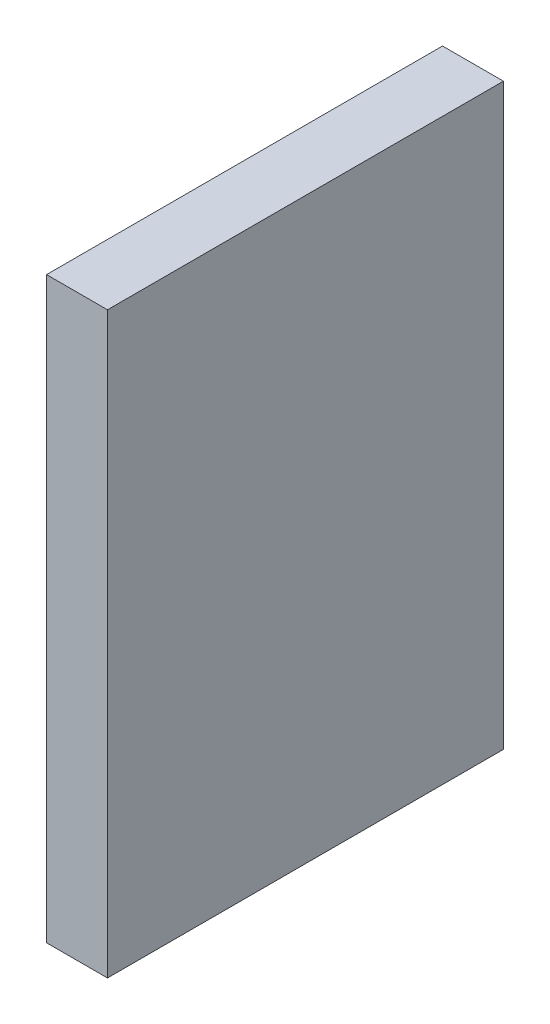
ISO-10303-21;
HEADER;
FILE_DESCRIPTION(('STEP AP214'),'2;1');
FILE_NAME('part.step','',(''),(''),'','','');
FILE_SCHEMA(('AUTOMOTIVE_DESIGN { 1 0 10303 214 1 1 1 1 }'));
ENDSEC;
DATA;
#1=APPLICATION_CONTEXT('core data for automotive mechanical design processes');
#2=APPLICATION_PROTOCOL_DEFINITION('international standard','automotive_design',2000,#1);
#3=PRODUCT_CONTEXT('',#1,'mechanical');
#4=PRODUCT('Part','Part','',(#3));
#5=PRODUCT_RELATED_PRODUCT_CATEGORY('part','',(#4));
#6=PRODUCT_DEFINITION_FORMATION('','',#4);
#7=PRODUCT_DEFINITION_CONTEXT('part definition',#1,'design');
#8=PRODUCT_DEFINITION('design','',#6,#7);
#9=PRODUCT_DEFINITION_SHAPE('','',#8);
#10=(LENGTH_UNIT() NAMED_UNIT(*) SI_UNIT(.MILLI.,.METRE.));
#11=(NAMED_UNIT(*) PLANE_ANGLE_UNIT() SI_UNIT($,.RADIAN.));
#12=(NAMED_UNIT(*) SI_UNIT($,.STERADIAN.) SOLID_ANGLE_UNIT());
#13=UNCERTAINTY_MEASURE_WITH_UNIT(LENGTH_MEASURE(1.E-05),#10,'distance_accuracy_value','');
#14=(GEOMETRIC_REPRESENTATION_CONTEXT(3) GLOBAL_UNCERTAINTY_ASSIGNED_CONTEXT((#13)) GLOBAL_UNIT_ASSIGNED_CONTEXT((#10,
#11,#12)) REPRESENTATION_CONTEXT('',''));
#15=CARTESIAN_POINT('',(0.,0.,0.));
#16=DIRECTION('',(0.,0.,1.));
#17=DIRECTION('',(1.,0.,0.));
#18=AXIS2_PLACEMENT_3D('',#15,#16,#17);
#19=CARTESIAN_POINT('',(0.,9.5,-13.));
#20=DIRECTION('',(0.,-1.,0.));
#21=DIRECTION('',(0.,0.,-1.));
#22=AXIS2_PLACEMENT_3D('',#19,#20,#21);
#23=PLANE('',#22);
#24=DIRECTION('',(1.,0.,0.));
#25=VECTOR('',#24,1.);
#26=CARTESIAN_POINT('',(0.,9.5,0.));
#27=LINE('',#26,#25);
#28=CARTESIAN_POINT('',(0.,9.5,0.));
#29=VERTEX_POINT('',#28);
#30=CARTESIAN_POINT('',(2.,9.5,0.));
#31=VERTEX_POINT('',#30);
#32=EDGE_CURVE('E88',#29,#31,#27,.T.);
#33=ORIENTED_EDGE('',*,*,#32,.T.);
#34=DIRECTION('',(0.,0.,1.));
#35=VECTOR('',#34,1.);
#36=CARTESIAN_POINT('',(2.,9.5,-13.));
#37=LINE('',#36,#35);
#38=CARTESIAN_POINT('',(2.,9.5,-13.));
#39=VERTEX_POINT('',#38);
#40=EDGE_CURVE('E42',#39,#31,#37,.T.);
#41=ORIENTED_EDGE('',*,*,#40,.F.);
#42=DIRECTION('',(1.,0.,0.));
#43=VECTOR('',#42,1.);
#44=CARTESIAN_POINT('',(0.,9.5,-13.));
#45=LINE('',#44,#43);
#46=CARTESIAN_POINT('',(0.,9.5,-13.));
#47=VERTEX_POINT('',#46);
#48=EDGE_CURVE('E80',#47,#39,#45,.T.);
#49=ORIENTED_EDGE('',*,*,#48,.F.);
#50=DIRECTION('',(0.,0.,1.));
#51=VECTOR('',#50,1.);
#52=CARTESIAN_POINT('',(0.,9.5,-13.));
#53=LINE('',#52,#51);
#54=EDGE_CURVE('E11',#47,#29,#53,.T.);
#55=ORIENTED_EDGE('',*,*,#54,.T.);
#56=EDGE_LOOP('',(#33,#41,#49,#55));
#57=FACE_BOUND('',#56,.T.);
#58=ADVANCED_FACE('F34',(#57),#23,.F.);
#59=CARTESIAN_POINT('',(2.,0.,-13.));
#60=DIRECTION('',(-1.,0.,0.));
#61=DIRECTION('',(0.,0.,1.));
#62=AXIS2_PLACEMENT_3D('',#59,#60,#61);
#63=PLANE('',#62);
#64=DIRECTION('',(0.,-1.,0.));
#65=VECTOR('',#64,1.);
#66=CARTESIAN_POINT('',(2.,0.,0.));
#67=LINE('',#66,#65);
#68=CARTESIAN_POINT('',(2.,-9.5,0.));
#69=VERTEX_POINT('',#68);
#70=EDGE_CURVE('E67',#31,#69,#67,.T.);
#71=ORIENTED_EDGE('',*,*,#70,.T.);
#72=DIRECTION('',(0.,0.,1.));
#73=VECTOR('',#72,1.);
#74=CARTESIAN_POINT('',(2.,-9.5,-13.));
#75=LINE('',#74,#73);
#76=CARTESIAN_POINT('',(2.,-9.5,-13.));
#77=VERTEX_POINT('',#76);
#78=EDGE_CURVE('E89',#77,#69,#75,.T.);
#79=ORIENTED_EDGE('',*,*,#78,.F.);
#80=DIRECTION('',(0.,-1.,0.));
#81=VECTOR('',#80,1.);
#82=CARTESIAN_POINT('',(2.,9.5,-13.));
#83=LINE('',#82,#81);
#84=EDGE_CURVE('E84',#39,#77,#83,.T.);
#85=ORIENTED_EDGE('',*,*,#84,.F.);
#86=ORIENTED_EDGE('',*,*,#40,.T.);
#87=EDGE_LOOP('',(#71,#79,#85,#86));
#88=FACE_BOUND('',#87,.T.);
#89=ADVANCED_FACE('F90',(#88),#63,.F.);
#90=CARTESIAN_POINT('',(0.,-9.5,-13.));
#91=DIRECTION('',(0.,1.,0.));
#92=DIRECTION('',(0.,0.,1.));
#93=AXIS2_PLACEMENT_3D('',#90,#91,#92);
#94=PLANE('',#93);
#95=DIRECTION('',(-1.,0.,0.));
#96=VECTOR('',#95,1.);
#97=CARTESIAN_POINT('',(0.,-9.5,0.));
#98=LINE('',#97,#96);
#99=CARTESIAN_POINT('',(0.,-9.5,0.));
#100=VERTEX_POINT('',#99);
#101=EDGE_CURVE('E74',#69,#100,#98,.T.);
#102=ORIENTED_EDGE('',*,*,#101,.T.);
#103=DIRECTION('',(0.,0.,1.));
#104=VECTOR('',#103,1.);
#105=CARTESIAN_POINT('',(0.,-9.5,-13.));
#106=LINE('',#105,#104);
#107=CARTESIAN_POINT('',(0.,-9.5,-13.));
#108=VERTEX_POINT('',#107);
#109=EDGE_CURVE('E94',#108,#100,#106,.T.);
#110=ORIENTED_EDGE('',*,*,#109,.F.);
#111=DIRECTION('',(-1.,0.,0.));
#112=VECTOR('',#111,1.);
#113=CARTESIAN_POINT('',(0.,-9.5,-13.));
#114=LINE('',#113,#112);
#115=EDGE_CURVE('E92',#77,#108,#114,.T.);
#116=ORIENTED_EDGE('',*,*,#115,.F.);
#117=ORIENTED_EDGE('',*,*,#78,.T.);
#118=EDGE_LOOP('',(#102,#110,#116,#117));
#119=FACE_BOUND('',#118,.T.);
#120=ADVANCED_FACE('F104',(#119),#94,.F.);
#121=CARTESIAN_POINT('',(0.,0.,-13.));
#122=DIRECTION('',(1.,0.,0.));
#123=DIRECTION('',(0.,0.,-1.));
#124=AXIS2_PLACEMENT_3D('',#121,#122,#123);
#125=PLANE('',#124);
#126=DIRECTION('',(0.,1.,0.));
#127=VECTOR('',#126,1.);
#128=CARTESIAN_POINT('',(0.,0.,0.));
#129=LINE('',#128,#127);
#130=EDGE_CURVE('E101',#100,#29,#129,.T.);
#131=ORIENTED_EDGE('',*,*,#130,.T.);
#132=ORIENTED_EDGE('',*,*,#54,.F.);
#133=DIRECTION('',(0.,1.,0.));
#134=VECTOR('',#133,1.);
#135=CARTESIAN_POINT('',(0.,9.5,-13.));
#136=LINE('',#135,#134);
#137=EDGE_CURVE('E50',#108,#47,#136,.T.);
#138=ORIENTED_EDGE('',*,*,#137,.F.);
#139=ORIENTED_EDGE('',*,*,#109,.T.);
#140=EDGE_LOOP('',(#131,#132,#138,#139));
#141=FACE_BOUND('',#140,.T.);
#142=ADVANCED_FACE('F108',(#141),#125,.F.);
#143=CARTESIAN_POINT('',(0.,0.,-13.));
#144=DIRECTION('',(0.,0.,1.));
#145=DIRECTION('',(1.,0.,0.));
#146=AXIS2_PLACEMENT_3D('',#143,#144,#145);
#147=PLANE('',#146);
#148=ORIENTED_EDGE('',*,*,#137,.T.);
#149=ORIENTED_EDGE('',*,*,#48,.T.);
#150=ORIENTED_EDGE('',*,*,#84,.T.);
#151=ORIENTED_EDGE('',*,*,#115,.T.);
#152=EDGE_LOOP('',(#148,#149,#150,#151));
#153=FACE_BOUND('',#152,.T.);
#154=ADVANCED_FACE('F82',(#153),#147,.F.);
#155=CARTESIAN_POINT('',(0.,0.,0.));
#156=DIRECTION('',(0.,0.,1.));
#157=DIRECTION('',(1.,0.,0.));
#158=AXIS2_PLACEMENT_3D('',#155,#156,#157);
#159=PLANE('',#158);
#160=ORIENTED_EDGE('',*,*,#32,.F.);
#161=ORIENTED_EDGE('',*,*,#130,.F.);
#162=ORIENTED_EDGE('',*,*,#101,.F.);
#163=ORIENTED_EDGE('',*,*,#70,.F.);
#164=EDGE_LOOP('',(#160,#161,#162,#163));
#165=FACE_BOUND('',#164,.T.);
#166=ADVANCED_FACE('F107',(#165),#159,.T.);
#167=CLOSED_SHELL('',(#58,#89,#120,#142,#154,#166));
#168=MANIFOLD_SOLID_BREP('B2',#167);
#169=ADVANCED_BREP_SHAPE_REPRESENTATION('',(#18,#168),#14);
#170=SHAPE_DEFINITION_REPRESENTATION(#9,#169);
ENDSEC;
END-ISO-10303-21;
